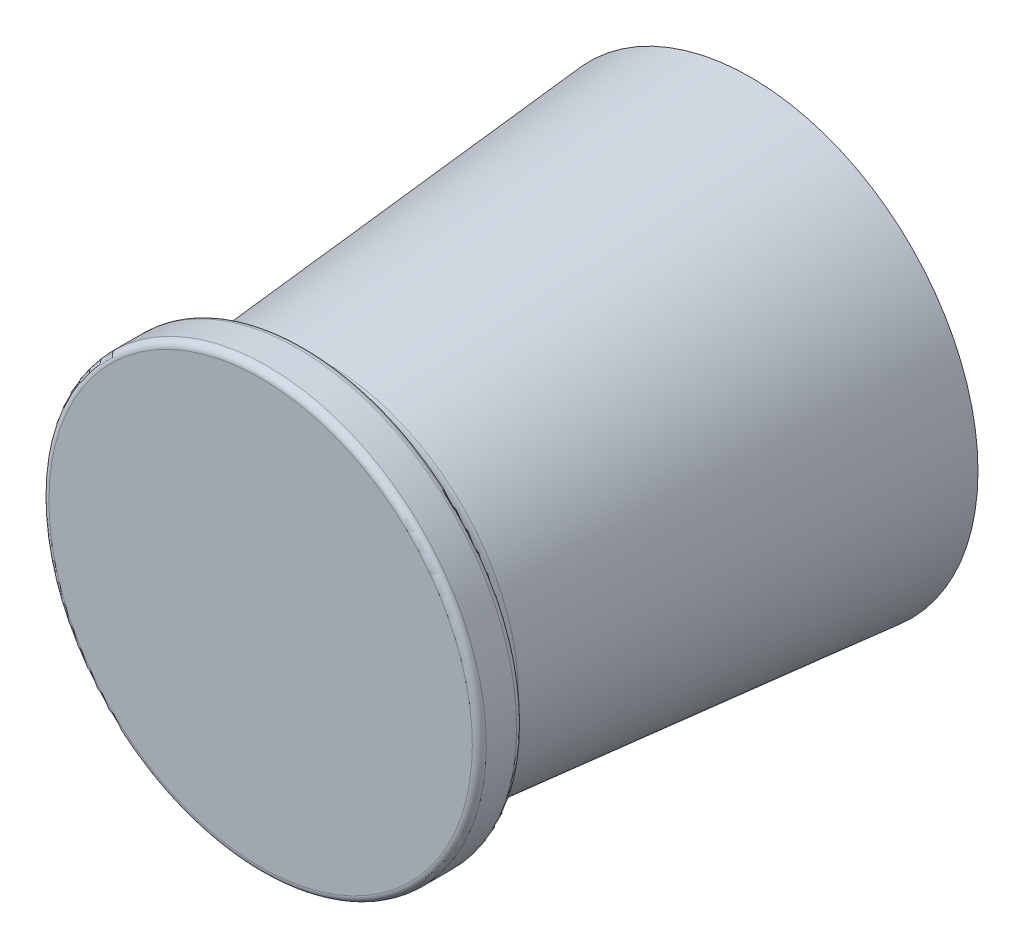
ISO-10303-21;
HEADER;
FILE_DESCRIPTION(('STEP AP214'),'2;1');
FILE_NAME('part.step','',(''),(''),'','','');
FILE_SCHEMA(('AUTOMOTIVE_DESIGN { 1 0 10303 214 1 1 1 1 }'));
ENDSEC;
DATA;
#1=APPLICATION_CONTEXT('core data for automotive mechanical design processes');
#2=APPLICATION_PROTOCOL_DEFINITION('international standard','automotive_design',2000,#1);
#3=PRODUCT_CONTEXT('',#1,'mechanical');
#4=PRODUCT('Part','Part','',(#3));
#5=PRODUCT_RELATED_PRODUCT_CATEGORY('part','',(#4));
#6=PRODUCT_DEFINITION_FORMATION('','',#4);
#7=PRODUCT_DEFINITION_CONTEXT('part definition',#1,'design');
#8=PRODUCT_DEFINITION('design','',#6,#7);
#9=PRODUCT_DEFINITION_SHAPE('','',#8);
#10=(LENGTH_UNIT() NAMED_UNIT(*) SI_UNIT(.MILLI.,.METRE.));
#11=(NAMED_UNIT(*) PLANE_ANGLE_UNIT() SI_UNIT($,.RADIAN.));
#12=(NAMED_UNIT(*) SI_UNIT($,.STERADIAN.) SOLID_ANGLE_UNIT());
#13=UNCERTAINTY_MEASURE_WITH_UNIT(LENGTH_MEASURE(1.E-05),#10,'distance_accuracy_value','');
#14=(GEOMETRIC_REPRESENTATION_CONTEXT(3) GLOBAL_UNCERTAINTY_ASSIGNED_CONTEXT((#13)) GLOBAL_UNIT_ASSIGNED_CONTEXT((#10,
#11,#12)) REPRESENTATION_CONTEXT('',''));
#15=CARTESIAN_POINT('',(0.,0.,0.));
#16=DIRECTION('',(0.,0.,1.));
#17=DIRECTION('',(1.,0.,0.));
#18=AXIS2_PLACEMENT_3D('',#15,#16,#17);
#19=CARTESIAN_POINT('',(0.,0.,0.));
#20=DIRECTION('',(0.,0.,-1.));
#21=DIRECTION('',(-1.,0.,0.));
#22=AXIS2_PLACEMENT_3D('',#19,#20,#21);
#23=CONICAL_SURFACE('',#22,8.255,0.0872664625997165);
#24=CARTESIAN_POINT('',(0.,0.,15.3379660585838));
#25=DIRECTION('',(0.,0.,-1.));
#26=DIRECTION('',(1.,0.,0.));
#27=AXIS2_PLACEMENT_3D('',#24,#25,#26);
#28=CIRCLE('',#27,6.91310184832852);
#29=CARTESIAN_POINT('',(6.91310184832852,0.,15.3379660585838));
#30=VERTEX_POINT('',#29);
#31=EDGE_CURVE('E11',#30,#30,#28,.T.);
#32=ORIENTED_EDGE('',*,*,#31,.T.);
#33=EDGE_LOOP('',(#32));
#34=FACE_BOUND('',#33,.T.);
#35=CARTESIAN_POINT('',(0.,0.,0.));
#36=DIRECTION('',(0.,0.,1.));
#37=DIRECTION('',(1.,0.,0.));
#38=AXIS2_PLACEMENT_3D('',#35,#36,#37);
#39=CIRCLE('',#38,8.255);
#40=CARTESIAN_POINT('',(8.255,0.,0.));
#41=VERTEX_POINT('',#40);
#42=EDGE_CURVE('E78',#41,#41,#39,.T.);
#43=ORIENTED_EDGE('',*,*,#42,.T.);
#44=EDGE_LOOP('',(#43));
#45=FACE_BOUND('',#44,.T.);
#46=ADVANCED_FACE('F32',(#34,#45),#23,.T.);
#47=CARTESIAN_POINT('',(0.,0.,17.78));
#48=DIRECTION('',(0.,0.,1.));
#49=DIRECTION('',(1.,0.,0.));
#50=AXIS2_PLACEMENT_3D('',#47,#48,#49);
#51=PLANE('',#50);
#52=CARTESIAN_POINT('',(0.,0.,17.78));
#53=DIRECTION('',(0.,0.,-1.));
#54=DIRECTION('',(1.,0.,0.));
#55=AXIS2_PLACEMENT_3D('',#52,#53,#54);
#56=CIRCLE('',#55,7.6835);
#57=CARTESIAN_POINT('',(7.6835,0.,17.78));
#58=VERTEX_POINT('',#57);
#59=CARTESIAN_POINT('',(-7.6835,0.,17.78));
#60=VERTEX_POINT('',#59);
#61=EDGE_CURVE('E50',#58,#60,#56,.T.);
#62=ORIENTED_EDGE('',*,*,#61,.F.);
#63=CARTESIAN_POINT('',(0.,0.,17.78));
#64=DIRECTION('',(0.,0.,-1.));
#65=DIRECTION('',(-1.,0.,0.));
#66=AXIS2_PLACEMENT_3D('',#63,#64,#65);
#67=CIRCLE('',#66,7.6835);
#68=EDGE_CURVE('E81',#60,#58,#67,.T.);
#69=ORIENTED_EDGE('',*,*,#68,.F.);
#70=EDGE_LOOP('',(#62,#69));
#71=FACE_BOUND('',#70,.T.);
#72=ADVANCED_FACE('F34',(#71),#51,.T.);
#73=CARTESIAN_POINT('',(0.,0.,17.526));
#74=DIRECTION('',(0.,0.,1.));
#75=DIRECTION('',(1.,0.,0.));
#76=AXIS2_PLACEMENT_3D('',#73,#74,#75);
#77=TOROIDAL_SURFACE('',#76,7.6835,0.254);
#78=CARTESIAN_POINT('',(0.,0.,17.526));
#79=DIRECTION('',(0.,0.,1.));
#80=DIRECTION('',(1.,0.,0.));
#81=AXIS2_PLACEMENT_3D('',#78,#79,#80);
#82=CIRCLE('',#81,7.9375);
#83=CARTESIAN_POINT('',(7.9375,0.,17.526));
#84=VERTEX_POINT('',#83);
#85=EDGE_CURVE('E111',#84,#84,#82,.F.);
#86=ORIENTED_EDGE('',*,*,#85,.F.);
#87=EDGE_LOOP('',(#86));
#88=FACE_BOUND('',#87,.T.);
#89=ORIENTED_EDGE('',*,*,#61,.T.);
#90=ORIENTED_EDGE('',*,*,#68,.T.);
#91=EDGE_LOOP('',(#89,#90));
#92=FACE_BOUND('',#91,.T.);
#93=ADVANCED_FACE('F124',(#88,#92),#77,.T.);
#94=CARTESIAN_POINT('',(0.,0.,16.98625));
#95=DIRECTION('',(0.,0.,1.));
#96=DIRECTION('',(1.,0.,0.));
#97=AXIS2_PLACEMENT_3D('',#94,#95,#96);
#98=CYLINDRICAL_SURFACE('',#97,7.9375);
#99=CARTESIAN_POINT('',(0.,0.,16.4252481182004));
#100=DIRECTION('',(0.,0.,1.));
#101=DIRECTION('',(1.,0.,0.));
#102=AXIS2_PLACEMENT_3D('',#99,#100,#101);
#103=CIRCLE('',#102,7.9375);
#104=CARTESIAN_POINT('',(7.9375,0.,16.4252481182004));
#105=VERTEX_POINT('',#104);
#106=EDGE_CURVE('E107',#105,#105,#103,.F.);
#107=ORIENTED_EDGE('',*,*,#106,.F.);
#108=EDGE_LOOP('',(#107));
#109=FACE_BOUND('',#108,.T.);
#110=ORIENTED_EDGE('',*,*,#85,.T.);
#111=EDGE_LOOP('',(#110));
#112=FACE_BOUND('',#111,.T.);
#113=ADVANCED_FACE('F101',(#109,#112),#98,.T.);
#114=CARTESIAN_POINT('',(0.,0.,16.4252481182004));
#115=DIRECTION('',(0.,0.,1.));
#116=DIRECTION('',(1.,0.,0.));
#117=AXIS2_PLACEMENT_3D('',#114,#115,#116);
#118=TOROIDAL_SURFACE('',#117,7.6835,0.254);
#119=CARTESIAN_POINT('',(0.,0.,16.1722146648851));
#120=DIRECTION('',(0.,0.,1.));
#121=DIRECTION('',(1.,0.,0.));
#122=AXIS2_PLACEMENT_3D('',#119,#120,#121);
#123=CIRCLE('',#122,7.70563755865792);
#124=CARTESIAN_POINT('',(7.70563755865792,0.,16.1722146648851));
#125=VERTEX_POINT('',#124);
#126=EDGE_CURVE('E110',#125,#125,#123,.F.);
#127=ORIENTED_EDGE('',*,*,#126,.F.);
#128=EDGE_LOOP('',(#127));
#129=FACE_BOUND('',#128,.T.);
#130=ORIENTED_EDGE('',*,*,#106,.T.);
#131=EDGE_LOOP('',(#130));
#132=FACE_BOUND('',#131,.T.);
#133=ADVANCED_FACE('F96',(#129,#132),#118,.T.);
#134=CARTESIAN_POINT('',(0.,0.,16.1722146648851));
#135=DIRECTION('',(0.,0.,1.));
#136=DIRECTION('',(1.,0.,0.));
#137=AXIS2_PLACEMENT_3D('',#134,#135,#136);
#138=CONICAL_SURFACE('',#137,7.70563755865792,1.48352986419516);
#139=CARTESIAN_POINT('',(0.,0.,16.1634790945034));
#140=DIRECTION('',(0.,0.,1.));
#141=DIRECTION('',(1.,0.,0.));
#142=AXIS2_PLACEMENT_3D('',#139,#140,#141);
#143=CIRCLE('',#142,7.6057895323007);
#144=CARTESIAN_POINT('',(7.6057895323007,0.,16.1634790945034));
#145=VERTEX_POINT('',#144);
#146=EDGE_CURVE('E44',#145,#145,#143,.T.);
#147=ORIENTED_EDGE('',*,*,#146,.T.);
#148=EDGE_LOOP('',(#147));
#149=FACE_BOUND('',#148,.T.);
#150=ORIENTED_EDGE('',*,*,#126,.T.);
#151=EDGE_LOOP('',(#150));
#152=FACE_BOUND('',#151,.T.);
#153=ADVANCED_FACE('F91',(#149,#152),#138,.T.);
#154=CARTESIAN_POINT('',(0.,0.,15.4043787345575));
#155=DIRECTION('',(0.,0.,1.));
#156=DIRECTION('',(1.,0.,0.));
#157=AXIS2_PLACEMENT_3D('',#154,#155,#156);
#158=TOROIDAL_SURFACE('',#157,7.67220220827439,0.761999999999977);
#159=ORIENTED_EDGE('',*,*,#146,.F.);
#160=EDGE_LOOP('',(#159));
#161=FACE_BOUND('',#160,.T.);
#162=ORIENTED_EDGE('',*,*,#31,.F.);
#163=EDGE_LOOP('',(#162));
#164=FACE_BOUND('',#163,.T.);
#165=ADVANCED_FACE('F86',(#161,#164),#158,.F.);
#166=CARTESIAN_POINT('',(0.,0.,0.));
#167=DIRECTION('',(0.,0.,1.));
#168=DIRECTION('',(1.,0.,0.));
#169=AXIS2_PLACEMENT_3D('',#166,#167,#168);
#170=PLANE('',#169);
#171=CARTESIAN_POINT('',(0.,0.,0.));
#172=DIRECTION('',(0.,0.,-1.));
#173=DIRECTION('',(-1.,0.,0.));
#174=AXIS2_PLACEMENT_3D('',#171,#172,#173);
#175=CIRCLE('',#174,2.65430000000001);
#176=CARTESIAN_POINT('',(-2.65430000000001,0.,0.));
#177=VERTEX_POINT('',#176);
#178=EDGE_CURVE('E67',#177,#177,#175,.T.);
#179=ORIENTED_EDGE('',*,*,#178,.F.);
#180=EDGE_LOOP('',(#179));
#181=FACE_BOUND('',#180,.T.);
#182=ORIENTED_EDGE('',*,*,#42,.F.);
#183=EDGE_LOOP('',(#182));
#184=FACE_BOUND('',#183,.T.);
#185=ADVANCED_FACE('F90',(#181,#184),#170,.F.);
#186=CARTESIAN_POINT('',(0.,0.,3.81));
#187=DIRECTION('',(0.,0.,1.));
#188=DIRECTION('',(1.,0.,0.));
#189=AXIS2_PLACEMENT_3D('',#186,#187,#188);
#190=PLANE('',#189);
#191=CARTESIAN_POINT('',(0.,0.,3.81));
#192=DIRECTION('',(0.,0.,-1.));
#193=DIRECTION('',(-1.,0.,0.));
#194=AXIS2_PLACEMENT_3D('',#191,#192,#193);
#195=CIRCLE('',#194,2.15264999999999);
#196=CARTESIAN_POINT('',(-2.15264999999999,0.,3.81));
#197=VERTEX_POINT('',#196);
#198=EDGE_CURVE('E68',#197,#197,#195,.T.);
#199=ORIENTED_EDGE('',*,*,#198,.F.);
#200=EDGE_LOOP('',(#199));
#201=FACE_BOUND('',#200,.T.);
#202=CARTESIAN_POINT('',(0.,0.,3.80999999999999));
#203=DIRECTION('',(0.,0.,-1.));
#204=DIRECTION('',(-1.,0.,0.));
#205=AXIS2_PLACEMENT_3D('',#202,#203,#204);
#206=CIRCLE('',#205,2.52730000000001);
#207=CARTESIAN_POINT('',(-2.52730000000001,0.,3.80999999999999));
#208=VERTEX_POINT('',#207);
#209=EDGE_CURVE('E71',#208,#208,#206,.T.);
#210=ORIENTED_EDGE('',*,*,#209,.T.);
#211=EDGE_LOOP('',(#210));
#212=FACE_BOUND('',#211,.T.);
#213=ADVANCED_FACE('F161',(#201,#212),#190,.F.);
#214=CARTESIAN_POINT('',(0.,0.,0.));
#215=DIRECTION('',(0.,0.,-1.));
#216=DIRECTION('',(-1.,0.,0.));
#217=AXIS2_PLACEMENT_3D('',#214,#215,#216);
#218=CONICAL_SURFACE('',#217,2.65430000000001,0.0333209958782472);
#219=ORIENTED_EDGE('',*,*,#209,.F.);
#220=EDGE_LOOP('',(#219));
#221=FACE_BOUND('',#220,.T.);
#222=ORIENTED_EDGE('',*,*,#178,.T.);
#223=EDGE_LOOP('',(#222));
#224=FACE_BOUND('',#223,.T.);
#225=ADVANCED_FACE('F61',(#221,#224),#218,.F.);
#226=CARTESIAN_POINT('',(0.,0.,13.335));
#227=DIRECTION('',(0.,0.,-1.));
#228=DIRECTION('',(-1.,0.,0.));
#229=AXIS2_PLACEMENT_3D('',#226,#227,#228);
#230=CONICAL_SURFACE('',#229,2.15265,1.02974425867665);
#231=CARTESIAN_POINT('',(0.,0.,14.6284426115497));
#232=VERTEX_POINT('',#231);
#233=VERTEX_LOOP('',#232);
#234=FACE_BOUND('',#233,.T.);
#235=CARTESIAN_POINT('',(0.,0.,13.335));
#236=DIRECTION('',(0.,0.,-1.));
#237=DIRECTION('',(-1.,0.,0.));
#238=AXIS2_PLACEMENT_3D('',#235,#236,#237);
#239=CIRCLE('',#238,2.15265);
#240=CARTESIAN_POINT('',(-2.15265,0.,13.335));
#241=VERTEX_POINT('',#240);
#242=EDGE_CURVE('E65',#241,#241,#239,.T.);
#243=ORIENTED_EDGE('',*,*,#242,.T.);
#244=EDGE_LOOP('',(#243));
#245=FACE_BOUND('',#244,.T.);
#246=ADVANCED_FACE('F57',(#234,#245),#230,.F.);
#247=CARTESIAN_POINT('',(0.,0.,3.81));
#248=DIRECTION('',(0.,0.,-1.));
#249=DIRECTION('',(-1.,0.,0.));
#250=AXIS2_PLACEMENT_3D('',#247,#248,#249);
#251=CYLINDRICAL_SURFACE('',#250,2.15264999999999);
#252=ORIENTED_EDGE('',*,*,#242,.F.);
#253=EDGE_LOOP('',(#252));
#254=FACE_BOUND('',#253,.T.);
#255=ORIENTED_EDGE('',*,*,#198,.T.);
#256=EDGE_LOOP('',(#255));
#257=FACE_BOUND('',#256,.T.);
#258=ADVANCED_FACE('F60',(#254,#257),#251,.F.);
#259=CLOSED_SHELL('',(#46,#72,#93,#113,#133,#153,#165,#185,#213,#225,#246,#258));
#260=MANIFOLD_SOLID_BREP('B2',#259);
#261=ADVANCED_BREP_SHAPE_REPRESENTATION('',(#18,#260),#14);
#262=SHAPE_DEFINITION_REPRESENTATION(#9,#261);
ENDSEC;
END-ISO-10303-21;
